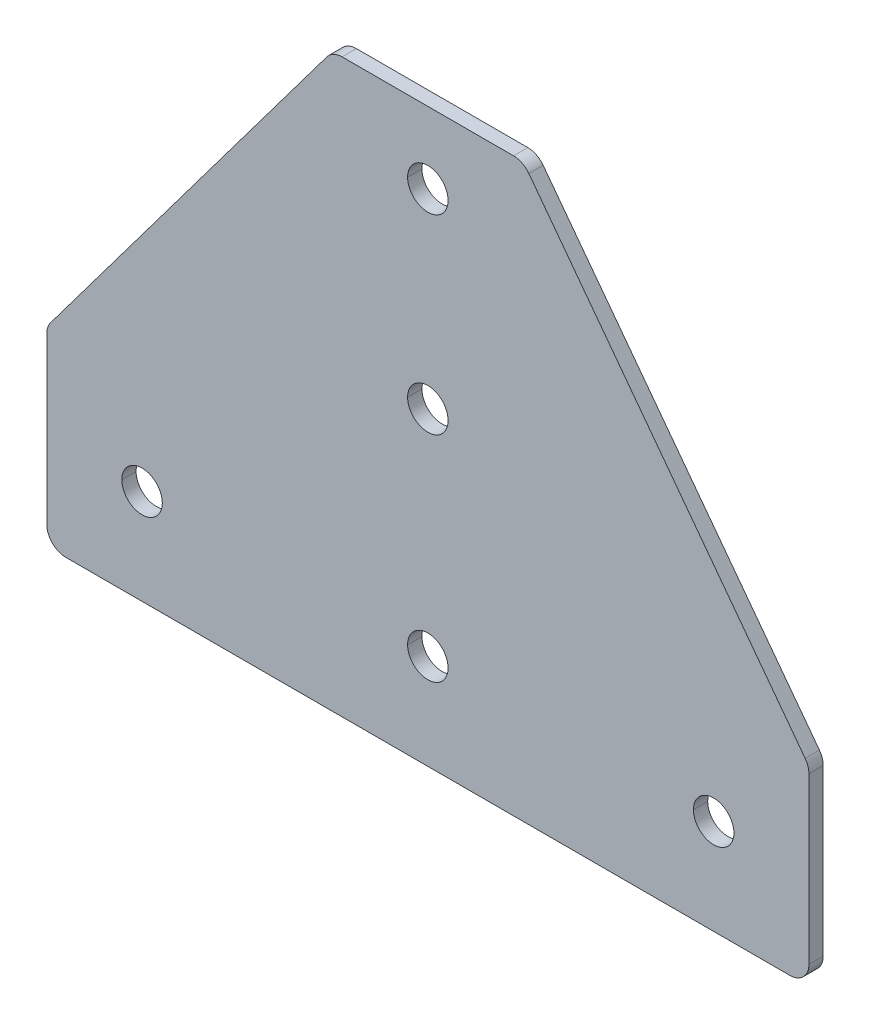
ISO-10303-21;
HEADER;
FILE_DESCRIPTION(('STEP AP214'),'2;1');
FILE_NAME('part.step','',(''),(''),'','','');
FILE_SCHEMA(('AUTOMOTIVE_DESIGN { 1 0 10303 214 1 1 1 1 }'));
ENDSEC;
DATA;
#1=APPLICATION_CONTEXT('core data for automotive mechanical design processes');
#2=APPLICATION_PROTOCOL_DEFINITION('international standard','automotive_design',2000,#1);
#3=PRODUCT_CONTEXT('',#1,'mechanical');
#4=PRODUCT('Part','Part','',(#3));
#5=PRODUCT_RELATED_PRODUCT_CATEGORY('part','',(#4));
#6=PRODUCT_DEFINITION_FORMATION('','',#4);
#7=PRODUCT_DEFINITION_CONTEXT('part definition',#1,'design');
#8=PRODUCT_DEFINITION('design','',#6,#7);
#9=PRODUCT_DEFINITION_SHAPE('','',#8);
#10=(LENGTH_UNIT() NAMED_UNIT(*) SI_UNIT(.MILLI.,.METRE.));
#11=(NAMED_UNIT(*) PLANE_ANGLE_UNIT() SI_UNIT($,.RADIAN.));
#12=(NAMED_UNIT(*) SI_UNIT($,.STERADIAN.) SOLID_ANGLE_UNIT());
#13=UNCERTAINTY_MEASURE_WITH_UNIT(LENGTH_MEASURE(1.E-05),#10,'distance_accuracy_value','');
#14=(GEOMETRIC_REPRESENTATION_CONTEXT(3) GLOBAL_UNCERTAINTY_ASSIGNED_CONTEXT((#13)) GLOBAL_UNIT_ASSIGNED_CONTEXT((#10,
#11,#12)) REPRESENTATION_CONTEXT('',''));
#15=CARTESIAN_POINT('',(0.,0.,0.));
#16=DIRECTION('',(0.,0.,1.));
#17=DIRECTION('',(1.,0.,0.));
#18=AXIS2_PLACEMENT_3D('',#15,#16,#17);
#19=CARTESIAN_POINT('',(0.,105.,3.));
#20=DIRECTION('',(0.,0.,-1.));
#21=DIRECTION('',(-1.,0.,0.));
#22=AXIS2_PLACEMENT_3D('',#19,#20,#21);
#23=CYLINDRICAL_SURFACE('',#22,4.25);
#24=DIRECTION('',(0.,0.,-1.));
#25=VECTOR('',#24,1.);
#26=CARTESIAN_POINT('',(4.25,105.,3.));
#27=LINE('',#26,#25);
#28=CARTESIAN_POINT('',(4.25,105.,3.));
#29=VERTEX_POINT('',#28);
#30=CARTESIAN_POINT('',(4.25,105.,0.));
#31=VERTEX_POINT('',#30);
#32=EDGE_CURVE('E436',#29,#31,#27,.T.);
#33=ORIENTED_EDGE('',*,*,#32,.F.);
#34=CARTESIAN_POINT('',(0.,105.,3.));
#35=DIRECTION('',(0.,0.,1.));
#36=DIRECTION('',(1.,0.,0.));
#37=AXIS2_PLACEMENT_3D('',#34,#35,#36);
#38=CIRCLE('',#37,4.25);
#39=CARTESIAN_POINT('',(-4.25,105.,3.));
#40=VERTEX_POINT('',#39);
#41=EDGE_CURVE('E306',#29,#40,#38,.T.);
#42=ORIENTED_EDGE('',*,*,#41,.T.);
#43=DIRECTION('',(0.,0.,-1.));
#44=VECTOR('',#43,1.);
#45=CARTESIAN_POINT('',(-4.25,105.,3.));
#46=LINE('',#45,#44);
#47=CARTESIAN_POINT('',(-4.25,105.,0.));
#48=VERTEX_POINT('',#47);
#49=EDGE_CURVE('E410',#40,#48,#46,.T.);
#50=ORIENTED_EDGE('',*,*,#49,.T.);
#51=CARTESIAN_POINT('',(0.,105.,0.));
#52=DIRECTION('',(0.,0.,1.));
#53=DIRECTION('',(1.,0.,0.));
#54=AXIS2_PLACEMENT_3D('',#51,#52,#53);
#55=CIRCLE('',#54,4.25);
#56=EDGE_CURVE('E251',#31,#48,#55,.T.);
#57=ORIENTED_EDGE('',*,*,#56,.F.);
#58=EDGE_LOOP('',(#33,#42,#50,#57));
#59=FACE_BOUND('',#58,.T.);
#60=ADVANCED_FACE('F16',(#59),#23,.F.);
#61=CARTESIAN_POINT('',(0.,65.,3.));
#62=DIRECTION('',(0.,0.,-1.));
#63=DIRECTION('',(-1.,0.,0.));
#64=AXIS2_PLACEMENT_3D('',#61,#62,#63);
#65=CYLINDRICAL_SURFACE('',#64,4.25);
#66=DIRECTION('',(0.,0.,-1.));
#67=VECTOR('',#66,1.);
#68=CARTESIAN_POINT('',(4.25,65.,3.));
#69=LINE('',#68,#67);
#70=CARTESIAN_POINT('',(4.25,65.,3.));
#71=VERTEX_POINT('',#70);
#72=CARTESIAN_POINT('',(4.25,65.,0.));
#73=VERTEX_POINT('',#72);
#74=EDGE_CURVE('E405',#71,#73,#69,.T.);
#75=ORIENTED_EDGE('',*,*,#74,.F.);
#76=CARTESIAN_POINT('',(0.,65.,3.));
#77=DIRECTION('',(0.,0.,1.));
#78=DIRECTION('',(1.,0.,0.));
#79=AXIS2_PLACEMENT_3D('',#76,#77,#78);
#80=CIRCLE('',#79,4.25);
#81=CARTESIAN_POINT('',(-4.25,65.,3.));
#82=VERTEX_POINT('',#81);
#83=EDGE_CURVE('E320',#71,#82,#80,.T.);
#84=ORIENTED_EDGE('',*,*,#83,.T.);
#85=DIRECTION('',(0.,0.,-1.));
#86=VECTOR('',#85,1.);
#87=CARTESIAN_POINT('',(-4.25,65.,3.));
#88=LINE('',#87,#86);
#89=CARTESIAN_POINT('',(-4.25,65.,0.));
#90=VERTEX_POINT('',#89);
#91=EDGE_CURVE('E397',#82,#90,#88,.T.);
#92=ORIENTED_EDGE('',*,*,#91,.T.);
#93=CARTESIAN_POINT('',(0.,65.,0.));
#94=DIRECTION('',(0.,0.,1.));
#95=DIRECTION('',(1.,0.,0.));
#96=AXIS2_PLACEMENT_3D('',#93,#94,#95);
#97=CIRCLE('',#96,4.25);
#98=EDGE_CURVE('E234',#73,#90,#97,.T.);
#99=ORIENTED_EDGE('',*,*,#98,.F.);
#100=EDGE_LOOP('',(#75,#84,#92,#99));
#101=FACE_BOUND('',#100,.T.);
#102=ADVANCED_FACE('F549',(#101),#65,.F.);
#103=CARTESIAN_POINT('',(-60.,20.,3.));
#104=DIRECTION('',(0.,0.,-1.));
#105=DIRECTION('',(-1.,0.,0.));
#106=AXIS2_PLACEMENT_3D('',#103,#104,#105);
#107=CYLINDRICAL_SURFACE('',#106,4.25);
#108=DIRECTION('',(0.,0.,-1.));
#109=VECTOR('',#108,1.);
#110=CARTESIAN_POINT('',(-55.75,20.,3.));
#111=LINE('',#110,#109);
#112=CARTESIAN_POINT('',(-55.75,20.,3.));
#113=VERTEX_POINT('',#112);
#114=CARTESIAN_POINT('',(-55.75,20.,0.));
#115=VERTEX_POINT('',#114);
#116=EDGE_CURVE('E392',#113,#115,#111,.T.);
#117=ORIENTED_EDGE('',*,*,#116,.F.);
#118=CARTESIAN_POINT('',(-60.,20.,3.));
#119=DIRECTION('',(0.,0.,1.));
#120=DIRECTION('',(1.,0.,0.));
#121=AXIS2_PLACEMENT_3D('',#118,#119,#120);
#122=CIRCLE('',#121,4.25);
#123=CARTESIAN_POINT('',(-64.25,20.,3.));
#124=VERTEX_POINT('',#123);
#125=EDGE_CURVE('E310',#113,#124,#122,.T.);
#126=ORIENTED_EDGE('',*,*,#125,.T.);
#127=DIRECTION('',(0.,0.,-1.));
#128=VECTOR('',#127,1.);
#129=CARTESIAN_POINT('',(-64.25,20.,3.));
#130=LINE('',#129,#128);
#131=CARTESIAN_POINT('',(-64.25,20.,0.));
#132=VERTEX_POINT('',#131);
#133=EDGE_CURVE('E391',#124,#132,#130,.T.);
#134=ORIENTED_EDGE('',*,*,#133,.T.);
#135=CARTESIAN_POINT('',(-60.,20.,0.));
#136=DIRECTION('',(0.,0.,1.));
#137=DIRECTION('',(1.,0.,0.));
#138=AXIS2_PLACEMENT_3D('',#135,#136,#137);
#139=CIRCLE('',#138,4.25);
#140=EDGE_CURVE('E248',#115,#132,#139,.T.);
#141=ORIENTED_EDGE('',*,*,#140,.F.);
#142=EDGE_LOOP('',(#117,#126,#134,#141));
#143=FACE_BOUND('',#142,.T.);
#144=ADVANCED_FACE('F18',(#143),#107,.F.);
#145=CARTESIAN_POINT('',(0.,20.,3.));
#146=DIRECTION('',(0.,0.,-1.));
#147=DIRECTION('',(-1.,0.,0.));
#148=AXIS2_PLACEMENT_3D('',#145,#146,#147);
#149=CYLINDRICAL_SURFACE('',#148,4.25);
#150=DIRECTION('',(0.,0.,-1.));
#151=VECTOR('',#150,1.);
#152=CARTESIAN_POINT('',(4.25,20.,3.));
#153=LINE('',#152,#151);
#154=CARTESIAN_POINT('',(4.25,20.,3.));
#155=VERTEX_POINT('',#154);
#156=CARTESIAN_POINT('',(4.25,20.,0.));
#157=VERTEX_POINT('',#156);
#158=EDGE_CURVE('E422',#155,#157,#153,.T.);
#159=ORIENTED_EDGE('',*,*,#158,.F.);
#160=CARTESIAN_POINT('',(0.,20.,3.));
#161=DIRECTION('',(0.,0.,1.));
#162=DIRECTION('',(1.,0.,0.));
#163=AXIS2_PLACEMENT_3D('',#160,#161,#162);
#164=CIRCLE('',#163,4.25);
#165=CARTESIAN_POINT('',(-4.25,20.,3.));
#166=VERTEX_POINT('',#165);
#167=EDGE_CURVE('E317',#155,#166,#164,.T.);
#168=ORIENTED_EDGE('',*,*,#167,.T.);
#169=DIRECTION('',(0.,0.,-1.));
#170=VECTOR('',#169,1.);
#171=CARTESIAN_POINT('',(-4.25,20.,3.));
#172=LINE('',#171,#170);
#173=CARTESIAN_POINT('',(-4.25,20.,0.));
#174=VERTEX_POINT('',#173);
#175=EDGE_CURVE('E386',#166,#174,#172,.T.);
#176=ORIENTED_EDGE('',*,*,#175,.T.);
#177=CARTESIAN_POINT('',(0.,20.,0.));
#178=DIRECTION('',(0.,0.,1.));
#179=DIRECTION('',(1.,0.,0.));
#180=AXIS2_PLACEMENT_3D('',#177,#178,#179);
#181=CIRCLE('',#180,4.25);
#182=EDGE_CURVE('E237',#157,#174,#181,.T.);
#183=ORIENTED_EDGE('',*,*,#182,.F.);
#184=EDGE_LOOP('',(#159,#168,#176,#183));
#185=FACE_BOUND('',#184,.T.);
#186=ADVANCED_FACE('F461',(#185),#149,.F.);
#187=CARTESIAN_POINT('',(60.,20.,3.));
#188=DIRECTION('',(0.,0.,-1.));
#189=DIRECTION('',(-1.,0.,0.));
#190=AXIS2_PLACEMENT_3D('',#187,#188,#189);
#191=CYLINDRICAL_SURFACE('',#190,4.25);
#192=DIRECTION('',(0.,0.,-1.));
#193=VECTOR('',#192,1.);
#194=CARTESIAN_POINT('',(64.25,20.,3.));
#195=LINE('',#194,#193);
#196=CARTESIAN_POINT('',(64.25,20.,3.));
#197=VERTEX_POINT('',#196);
#198=CARTESIAN_POINT('',(64.25,20.,0.));
#199=VERTEX_POINT('',#198);
#200=EDGE_CURVE('E378',#197,#199,#195,.T.);
#201=ORIENTED_EDGE('',*,*,#200,.F.);
#202=CARTESIAN_POINT('',(60.,20.,3.));
#203=DIRECTION('',(0.,0.,1.));
#204=DIRECTION('',(1.,0.,0.));
#205=AXIS2_PLACEMENT_3D('',#202,#203,#204);
#206=CIRCLE('',#205,4.25);
#207=CARTESIAN_POINT('',(55.75,20.,3.));
#208=VERTEX_POINT('',#207);
#209=EDGE_CURVE('E314',#197,#208,#206,.T.);
#210=ORIENTED_EDGE('',*,*,#209,.T.);
#211=DIRECTION('',(0.,0.,-1.));
#212=VECTOR('',#211,1.);
#213=CARTESIAN_POINT('',(55.75,20.,3.));
#214=LINE('',#213,#212);
#215=CARTESIAN_POINT('',(55.75,20.,0.));
#216=VERTEX_POINT('',#215);
#217=EDGE_CURVE('E370',#208,#216,#214,.T.);
#218=ORIENTED_EDGE('',*,*,#217,.T.);
#219=CARTESIAN_POINT('',(60.,20.,0.));
#220=DIRECTION('',(0.,0.,1.));
#221=DIRECTION('',(1.,0.,0.));
#222=AXIS2_PLACEMENT_3D('',#219,#220,#221);
#223=CIRCLE('',#222,4.25);
#224=EDGE_CURVE('E244',#199,#216,#223,.T.);
#225=ORIENTED_EDGE('',*,*,#224,.F.);
#226=EDGE_LOOP('',(#201,#210,#218,#225));
#227=FACE_BOUND('',#226,.T.);
#228=ADVANCED_FACE('F569',(#227),#191,.F.);
#229=CARTESIAN_POINT('',(-76.0000000000145,0.,3.));
#230=DIRECTION('',(0.,1.,0.));
#231=DIRECTION('',(1.,0.,0.));
#232=AXIS2_PLACEMENT_3D('',#229,#230,#231);
#233=PLANE('',#232);
#234=DIRECTION('',(1.,0.,0.));
#235=VECTOR('',#234,1.);
#236=CARTESIAN_POINT('',(-76.0000000000145,0.,0.));
#237=LINE('',#236,#235);
#238=CARTESIAN_POINT('',(-76.0000000000145,0.,0.));
#239=VERTEX_POINT('',#238);
#240=CARTESIAN_POINT('',(76.0000000000145,0.,0.));
#241=VERTEX_POINT('',#240);
#242=EDGE_CURVE('E296',#239,#241,#237,.T.);
#243=ORIENTED_EDGE('',*,*,#242,.T.);
#244=DIRECTION('',(0.,0.,-1.));
#245=VECTOR('',#244,1.);
#246=CARTESIAN_POINT('',(76.0000000000145,0.,3.));
#247=LINE('',#246,#245);
#248=CARTESIAN_POINT('',(76.0000000000145,0.,3.));
#249=VERTEX_POINT('',#248);
#250=EDGE_CURVE('E258',#249,#241,#247,.T.);
#251=ORIENTED_EDGE('',*,*,#250,.F.);
#252=DIRECTION('',(1.,0.,0.));
#253=VECTOR('',#252,1.);
#254=CARTESIAN_POINT('',(-76.0000000000145,0.,3.));
#255=LINE('',#254,#253);
#256=CARTESIAN_POINT('',(-76.0000000000145,0.,3.));
#257=VERTEX_POINT('',#256);
#258=EDGE_CURVE('E326',#257,#249,#255,.T.);
#259=ORIENTED_EDGE('',*,*,#258,.F.);
#260=DIRECTION('',(0.,0.,-1.));
#261=VECTOR('',#260,1.);
#262=CARTESIAN_POINT('',(-76.0000000000145,0.,3.));
#263=LINE('',#262,#261);
#264=EDGE_CURVE('E10',#257,#239,#263,.T.);
#265=ORIENTED_EDGE('',*,*,#264,.T.);
#266=EDGE_LOOP('',(#243,#251,#259,#265));
#267=FACE_BOUND('',#266,.T.);
#268=ADVANCED_FACE('F564',(#267),#233,.F.);
#269=CARTESIAN_POINT('',(-76.0000000000145,4.,3.));
#270=DIRECTION('',(0.,0.,-1.));
#271=DIRECTION('',(-1.,0.,0.));
#272=AXIS2_PLACEMENT_3D('',#269,#270,#271);
#273=CYLINDRICAL_SURFACE('',#272,4.);
#274=CARTESIAN_POINT('',(-76.0000000000145,4.,0.));
#275=DIRECTION('',(0.,0.,1.));
#276=DIRECTION('',(1.,0.,0.));
#277=AXIS2_PLACEMENT_3D('',#274,#275,#276);
#278=CIRCLE('',#277,4.);
#279=CARTESIAN_POINT('',(-80.0000000000146,4.,0.));
#280=VERTEX_POINT('',#279);
#281=EDGE_CURVE('E290',#280,#239,#278,.T.);
#282=ORIENTED_EDGE('',*,*,#281,.T.);
#283=ORIENTED_EDGE('',*,*,#264,.F.);
#284=CARTESIAN_POINT('',(-76.0000000000145,4.,3.));
#285=DIRECTION('',(0.,0.,1.));
#286=DIRECTION('',(1.,0.,0.));
#287=AXIS2_PLACEMENT_3D('',#284,#285,#286);
#288=CIRCLE('',#287,4.);
#289=CARTESIAN_POINT('',(-80.0000000000146,4.,3.));
#290=VERTEX_POINT('',#289);
#291=EDGE_CURVE('E332',#290,#257,#288,.T.);
#292=ORIENTED_EDGE('',*,*,#291,.F.);
#293=DIRECTION('',(0.,0.,-1.));
#294=VECTOR('',#293,1.);
#295=CARTESIAN_POINT('',(-80.0000000000146,4.,3.));
#296=LINE('',#295,#294);
#297=EDGE_CURVE('E26',#290,#280,#296,.T.);
#298=ORIENTED_EDGE('',*,*,#297,.T.);
#299=EDGE_LOOP('',(#282,#283,#292,#298));
#300=FACE_BOUND('',#299,.T.);
#301=ADVANCED_FACE('F560',(#300),#273,.T.);
#302=CARTESIAN_POINT('',(-80.0000000000146,4.,3.));
#303=DIRECTION('',(1.,0.,0.));
#304=DIRECTION('',(0.,1.,0.));
#305=AXIS2_PLACEMENT_3D('',#302,#303,#304);
#306=PLANE('',#305);
#307=DIRECTION('',(0.,-1.,0.));
#308=VECTOR('',#307,1.);
#309=CARTESIAN_POINT('',(-80.0000000000146,4.,0.));
#310=LINE('',#309,#308);
#311=CARTESIAN_POINT('',(-80.0000000000146,38.6666666666538,0.));
#312=VERTEX_POINT('',#311);
#313=EDGE_CURVE('E280',#312,#280,#310,.T.);
#314=ORIENTED_EDGE('',*,*,#313,.T.);
#315=ORIENTED_EDGE('',*,*,#297,.F.);
#316=DIRECTION('',(0.,-1.,0.));
#317=VECTOR('',#316,1.);
#318=CARTESIAN_POINT('',(-80.0000000000146,4.,3.));
#319=LINE('',#318,#317);
#320=CARTESIAN_POINT('',(-80.0000000000146,38.6666666666538,3.));
#321=VERTEX_POINT('',#320);
#322=EDGE_CURVE('E283',#321,#290,#319,.T.);
#323=ORIENTED_EDGE('',*,*,#322,.F.);
#324=DIRECTION('',(0.,0.,-1.));
#325=VECTOR('',#324,1.);
#326=CARTESIAN_POINT('',(-80.0000000000146,38.6666666666538,3.));
#327=LINE('',#326,#325);
#328=EDGE_CURVE('E20',#321,#312,#327,.T.);
#329=ORIENTED_EDGE('',*,*,#328,.T.);
#330=EDGE_LOOP('',(#314,#315,#323,#329));
#331=FACE_BOUND('',#330,.T.);
#332=ADVANCED_FACE('F278',(#331),#306,.F.);
#333=CARTESIAN_POINT('',(-76.0000000000145,38.6666666666538,3.));
#334=DIRECTION('',(0.,0.,-1.));
#335=DIRECTION('',(-1.,0.,0.));
#336=AXIS2_PLACEMENT_3D('',#333,#334,#335);
#337=CYLINDRICAL_SURFACE('',#336,4.);
#338=CARTESIAN_POINT('',(-76.0000000000145,38.6666666666538,0.));
#339=DIRECTION('',(0.,0.,1.));
#340=DIRECTION('',(1.,0.,0.));
#341=AXIS2_PLACEMENT_3D('',#338,#339,#340);
#342=CIRCLE('',#341,4.);
#343=CARTESIAN_POINT('',(-79.2000000000145,41.0666666666539,0.));
#344=VERTEX_POINT('',#343);
#345=EDGE_CURVE('E224',#344,#312,#342,.T.);
#346=ORIENTED_EDGE('',*,*,#345,.T.);
#347=ORIENTED_EDGE('',*,*,#328,.F.);
#348=CARTESIAN_POINT('',(-76.0000000000145,38.6666666666538,3.));
#349=DIRECTION('',(0.,0.,1.));
#350=DIRECTION('',(1.,0.,0.));
#351=AXIS2_PLACEMENT_3D('',#348,#349,#350);
#352=CIRCLE('',#351,4.);
#353=CARTESIAN_POINT('',(-79.2000000000145,41.0666666666539,3.));
#354=VERTEX_POINT('',#353);
#355=EDGE_CURVE('E341',#354,#321,#352,.T.);
#356=ORIENTED_EDGE('',*,*,#355,.F.);
#357=DIRECTION('',(0.,0.,-1.));
#358=VECTOR('',#357,1.);
#359=CARTESIAN_POINT('',(-79.2000000000145,41.0666666666539,3.));
#360=LINE('',#359,#358);
#361=EDGE_CURVE('E241',#354,#344,#360,.T.);
#362=ORIENTED_EDGE('',*,*,#361,.T.);
#363=EDGE_LOOP('',(#346,#347,#356,#362));
#364=FACE_BOUND('',#363,.T.);
#365=ADVANCED_FACE('F285',(#364),#337,.T.);
#366=CARTESIAN_POINT('',(-21.2,118.4,3.));
#367=DIRECTION('',(0.799999999999976,-0.600000000000032,0.));
#368=DIRECTION('',(0.,0.,-1.));
#369=AXIS2_PLACEMENT_3D('',#366,#367,#368);
#370=PLANE('',#369);
#371=DIRECTION('',(-0.600000000000032,-0.799999999999976,0.));
#372=VECTOR('',#371,1.);
#373=CARTESIAN_POINT('',(-21.2,118.4,0.));
#374=LINE('',#373,#372);
#375=CARTESIAN_POINT('',(-21.2,118.4,0.));
#376=VERTEX_POINT('',#375);
#377=EDGE_CURVE('E217',#376,#344,#374,.T.);
#378=ORIENTED_EDGE('',*,*,#377,.T.);
#379=ORIENTED_EDGE('',*,*,#361,.F.);
#380=DIRECTION('',(-0.600000000000032,-0.799999999999976,0.));
#381=VECTOR('',#380,1.);
#382=CARTESIAN_POINT('',(-21.2,118.4,3.));
#383=LINE('',#382,#381);
#384=CARTESIAN_POINT('',(-21.2,118.4,3.));
#385=VERTEX_POINT('',#384);
#386=EDGE_CURVE('E344',#385,#354,#383,.T.);
#387=ORIENTED_EDGE('',*,*,#386,.F.);
#388=DIRECTION('',(0.,0.,-1.));
#389=VECTOR('',#388,1.);
#390=CARTESIAN_POINT('',(-21.2,118.4,3.));
#391=LINE('',#390,#389);
#392=EDGE_CURVE('E201',#385,#376,#391,.T.);
#393=ORIENTED_EDGE('',*,*,#392,.T.);
#394=EDGE_LOOP('',(#378,#379,#387,#393));
#395=FACE_BOUND('',#394,.T.);
#396=ADVANCED_FACE('F537',(#395),#370,.F.);
#397=CARTESIAN_POINT('',(-18.0000000000003,116.,3.));
#398=DIRECTION('',(0.,0.,-1.));
#399=DIRECTION('',(-1.,0.,0.));
#400=AXIS2_PLACEMENT_3D('',#397,#398,#399);
#401=CYLINDRICAL_SURFACE('',#400,3.99999999999963);
#402=CARTESIAN_POINT('',(-18.0000000000003,116.,0.));
#403=DIRECTION('',(0.,0.,1.));
#404=DIRECTION('',(1.,0.,0.));
#405=AXIS2_PLACEMENT_3D('',#402,#403,#404);
#406=CIRCLE('',#405,3.99999999999963);
#407=CARTESIAN_POINT('',(-18.0000000000003,120.,0.));
#408=VERTEX_POINT('',#407);
#409=EDGE_CURVE('E193',#408,#376,#406,.T.);
#410=ORIENTED_EDGE('',*,*,#409,.T.);
#411=ORIENTED_EDGE('',*,*,#392,.F.);
#412=CARTESIAN_POINT('',(-18.0000000000003,116.,3.));
#413=DIRECTION('',(0.,0.,1.));
#414=DIRECTION('',(1.,0.,0.));
#415=AXIS2_PLACEMENT_3D('',#412,#413,#414);
#416=CIRCLE('',#415,3.99999999999963);
#417=CARTESIAN_POINT('',(-18.0000000000003,120.,3.));
#418=VERTEX_POINT('',#417);
#419=EDGE_CURVE('E196',#418,#385,#416,.T.);
#420=ORIENTED_EDGE('',*,*,#419,.F.);
#421=DIRECTION('',(0.,0.,-1.));
#422=VECTOR('',#421,1.);
#423=CARTESIAN_POINT('',(-18.0000000000003,120.,3.));
#424=LINE('',#423,#422);
#425=EDGE_CURVE('E189',#418,#408,#424,.T.);
#426=ORIENTED_EDGE('',*,*,#425,.T.);
#427=EDGE_LOOP('',(#410,#411,#420,#426));
#428=FACE_BOUND('',#427,.T.);
#429=ADVANCED_FACE('F191',(#428),#401,.T.);
#430=CARTESIAN_POINT('',(18.0000000000003,120.,3.));
#431=DIRECTION('',(0.,-1.,0.));
#432=DIRECTION('',(0.,0.,-1.));
#433=AXIS2_PLACEMENT_3D('',#430,#431,#432);
#434=PLANE('',#433);
#435=DIRECTION('',(-1.,0.,0.));
#436=VECTOR('',#435,1.);
#437=CARTESIAN_POINT('',(18.0000000000003,120.,0.));
#438=LINE('',#437,#436);
#439=CARTESIAN_POINT('',(18.0000000000003,120.,0.));
#440=VERTEX_POINT('',#439);
#441=EDGE_CURVE('E205',#440,#408,#438,.T.);
#442=ORIENTED_EDGE('',*,*,#441,.T.);
#443=ORIENTED_EDGE('',*,*,#425,.F.);
#444=DIRECTION('',(-1.,0.,0.));
#445=VECTOR('',#444,1.);
#446=CARTESIAN_POINT('',(18.0000000000003,120.,3.));
#447=LINE('',#446,#445);
#448=CARTESIAN_POINT('',(18.0000000000003,120.,3.));
#449=VERTEX_POINT('',#448);
#450=EDGE_CURVE('E350',#449,#418,#447,.T.);
#451=ORIENTED_EDGE('',*,*,#450,.F.);
#452=DIRECTION('',(0.,0.,-1.));
#453=VECTOR('',#452,1.);
#454=CARTESIAN_POINT('',(18.0000000000003,120.,3.));
#455=LINE('',#454,#453);
#456=EDGE_CURVE('E202',#449,#440,#455,.T.);
#457=ORIENTED_EDGE('',*,*,#456,.T.);
#458=EDGE_LOOP('',(#442,#443,#451,#457));
#459=FACE_BOUND('',#458,.T.);
#460=ADVANCED_FACE('F206',(#459),#434,.F.);
#461=CARTESIAN_POINT('',(18.0000000000003,116.,3.));
#462=DIRECTION('',(0.,0.,-1.));
#463=DIRECTION('',(-1.,0.,0.));
#464=AXIS2_PLACEMENT_3D('',#461,#462,#463);
#465=CYLINDRICAL_SURFACE('',#464,4.);
#466=CARTESIAN_POINT('',(18.0000000000003,116.,0.));
#467=DIRECTION('',(0.,0.,1.));
#468=DIRECTION('',(1.,0.,0.));
#469=AXIS2_PLACEMENT_3D('',#466,#467,#468);
#470=CIRCLE('',#469,4.);
#471=CARTESIAN_POINT('',(21.2,118.4,0.));
#472=VERTEX_POINT('',#471);
#473=EDGE_CURVE('E211',#472,#440,#470,.T.);
#474=ORIENTED_EDGE('',*,*,#473,.T.);
#475=ORIENTED_EDGE('',*,*,#456,.F.);
#476=CARTESIAN_POINT('',(18.0000000000003,116.,3.));
#477=DIRECTION('',(0.,0.,1.));
#478=DIRECTION('',(1.,0.,0.));
#479=AXIS2_PLACEMENT_3D('',#476,#477,#478);
#480=CIRCLE('',#479,4.);
#481=CARTESIAN_POINT('',(21.2,118.4,3.));
#482=VERTEX_POINT('',#481);
#483=EDGE_CURVE('E353',#482,#449,#480,.T.);
#484=ORIENTED_EDGE('',*,*,#483,.F.);
#485=DIRECTION('',(0.,0.,-1.));
#486=VECTOR('',#485,1.);
#487=CARTESIAN_POINT('',(21.2,118.4,3.));
#488=LINE('',#487,#486);
#489=EDGE_CURVE('E261',#482,#472,#488,.T.);
#490=ORIENTED_EDGE('',*,*,#489,.T.);
#491=EDGE_LOOP('',(#474,#475,#484,#490));
#492=FACE_BOUND('',#491,.T.);
#493=ADVANCED_FACE('F534',(#492),#465,.T.);
#494=CARTESIAN_POINT('',(21.2,118.4,3.));
#495=DIRECTION('',(-0.79999999999993,-0.600000000000093,0.));
#496=DIRECTION('',(-0.600000000000093,0.79999999999993,0.));
#497=AXIS2_PLACEMENT_3D('',#494,#495,#496);
#498=PLANE('',#497);
#499=DIRECTION('',(-0.600000000000093,0.79999999999993,0.));
#500=VECTOR('',#499,1.);
#501=CARTESIAN_POINT('',(21.2,118.4,0.));
#502=LINE('',#501,#500);
#503=CARTESIAN_POINT('',(79.2000000000143,41.0666666666668,0.));
#504=VERTEX_POINT('',#503);
#505=EDGE_CURVE('E230',#504,#472,#502,.T.);
#506=ORIENTED_EDGE('',*,*,#505,.T.);
#507=ORIENTED_EDGE('',*,*,#489,.F.);
#508=DIRECTION('',(-0.600000000000093,0.79999999999993,0.));
#509=VECTOR('',#508,1.);
#510=CARTESIAN_POINT('',(21.2,118.4,3.));
#511=LINE('',#510,#509);
#512=CARTESIAN_POINT('',(79.2000000000143,41.0666666666668,3.));
#513=VERTEX_POINT('',#512);
#514=EDGE_CURVE('E354',#513,#482,#511,.T.);
#515=ORIENTED_EDGE('',*,*,#514,.F.);
#516=DIRECTION('',(0.,0.,-1.));
#517=VECTOR('',#516,1.);
#518=CARTESIAN_POINT('',(79.2000000000143,41.0666666666668,3.));
#519=LINE('',#518,#517);
#520=EDGE_CURVE('E54',#513,#504,#519,.T.);
#521=ORIENTED_EDGE('',*,*,#520,.T.);
#522=EDGE_LOOP('',(#506,#507,#515,#521));
#523=FACE_BOUND('',#522,.T.);
#524=ADVANCED_FACE('F531',(#523),#498,.F.);
#525=CARTESIAN_POINT('',(76.0000000000145,38.6666666666664,3.));
#526=DIRECTION('',(0.,0.,-1.));
#527=DIRECTION('',(-1.,0.,0.));
#528=AXIS2_PLACEMENT_3D('',#525,#526,#527);
#529=CYLINDRICAL_SURFACE('',#528,4.);
#530=CARTESIAN_POINT('',(76.0000000000145,38.6666666666664,0.));
#531=DIRECTION('',(0.,0.,1.));
#532=DIRECTION('',(1.,0.,0.));
#533=AXIS2_PLACEMENT_3D('',#530,#531,#532);
#534=CIRCLE('',#533,4.);
#535=CARTESIAN_POINT('',(80.0000000000146,38.6666666666664,0.));
#536=VERTEX_POINT('',#535);
#537=EDGE_CURVE('E233',#536,#504,#534,.T.);
#538=ORIENTED_EDGE('',*,*,#537,.T.);
#539=ORIENTED_EDGE('',*,*,#520,.F.);
#540=CARTESIAN_POINT('',(76.0000000000145,38.6666666666664,3.));
#541=DIRECTION('',(0.,0.,1.));
#542=DIRECTION('',(1.,0.,0.));
#543=AXIS2_PLACEMENT_3D('',#540,#541,#542);
#544=CIRCLE('',#543,4.);
#545=CARTESIAN_POINT('',(80.0000000000146,38.6666666666664,3.));
#546=VERTEX_POINT('',#545);
#547=EDGE_CURVE('E358',#546,#513,#544,.T.);
#548=ORIENTED_EDGE('',*,*,#547,.F.);
#549=DIRECTION('',(0.,0.,-1.));
#550=VECTOR('',#549,1.);
#551=CARTESIAN_POINT('',(80.0000000000146,38.6666666666664,3.));
#552=LINE('',#551,#550);
#553=EDGE_CURVE('E40',#546,#536,#552,.T.);
#554=ORIENTED_EDGE('',*,*,#553,.T.);
#555=EDGE_LOOP('',(#538,#539,#548,#554));
#556=FACE_BOUND('',#555,.T.);
#557=ADVANCED_FACE('F529',(#556),#529,.T.);
#558=CARTESIAN_POINT('',(80.0000000000146,4.,3.));
#559=DIRECTION('',(-1.,0.,0.));
#560=DIRECTION('',(0.,1.,0.));
#561=AXIS2_PLACEMENT_3D('',#558,#559,#560);
#562=PLANE('',#561);
#563=DIRECTION('',(0.,1.,0.));
#564=VECTOR('',#563,1.);
#565=CARTESIAN_POINT('',(80.0000000000146,4.,0.));
#566=LINE('',#565,#564);
#567=CARTESIAN_POINT('',(80.0000000000146,4.,0.));
#568=VERTEX_POINT('',#567);
#569=EDGE_CURVE('E238',#568,#536,#566,.T.);
#570=ORIENTED_EDGE('',*,*,#569,.T.);
#571=ORIENTED_EDGE('',*,*,#553,.F.);
#572=DIRECTION('',(0.,1.,0.));
#573=VECTOR('',#572,1.);
#574=CARTESIAN_POINT('',(80.0000000000146,4.,3.));
#575=LINE('',#574,#573);
#576=CARTESIAN_POINT('',(80.0000000000146,4.,3.));
#577=VERTEX_POINT('',#576);
#578=EDGE_CURVE('E364',#577,#546,#575,.T.);
#579=ORIENTED_EDGE('',*,*,#578,.F.);
#580=DIRECTION('',(0.,0.,-1.));
#581=VECTOR('',#580,1.);
#582=CARTESIAN_POINT('',(80.0000000000146,4.,3.));
#583=LINE('',#582,#581);
#584=EDGE_CURVE('E255',#577,#568,#583,.T.);
#585=ORIENTED_EDGE('',*,*,#584,.T.);
#586=EDGE_LOOP('',(#570,#571,#579,#585));
#587=FACE_BOUND('',#586,.T.);
#588=ADVANCED_FACE('F527',(#587),#562,.F.);
#589=CARTESIAN_POINT('',(76.0000000000145,4.,3.));
#590=DIRECTION('',(0.,0.,-1.));
#591=DIRECTION('',(-1.,0.,0.));
#592=AXIS2_PLACEMENT_3D('',#589,#590,#591);
#593=CYLINDRICAL_SURFACE('',#592,4.);
#594=CARTESIAN_POINT('',(76.0000000000145,4.,0.));
#595=DIRECTION('',(0.,0.,1.));
#596=DIRECTION('',(1.,0.,0.));
#597=AXIS2_PLACEMENT_3D('',#594,#595,#596);
#598=CIRCLE('',#597,4.);
#599=EDGE_CURVE('E302',#241,#568,#598,.T.);
#600=ORIENTED_EDGE('',*,*,#599,.T.);
#601=ORIENTED_EDGE('',*,*,#584,.F.);
#602=CARTESIAN_POINT('',(76.0000000000145,4.,3.));
#603=DIRECTION('',(0.,0.,1.));
#604=DIRECTION('',(1.,0.,0.));
#605=AXIS2_PLACEMENT_3D('',#602,#603,#604);
#606=CIRCLE('',#605,4.);
#607=EDGE_CURVE('E366',#249,#577,#606,.T.);
#608=ORIENTED_EDGE('',*,*,#607,.F.);
#609=ORIENTED_EDGE('',*,*,#250,.T.);
#610=EDGE_LOOP('',(#600,#601,#608,#609));
#611=FACE_BOUND('',#610,.T.);
#612=ADVANCED_FACE('F524',(#611),#593,.T.);
#613=CARTESIAN_POINT('',(76.0000000000145,4.,0.));
#614=DIRECTION('',(0.,0.,1.));
#615=DIRECTION('',(1.,0.,0.));
#616=AXIS2_PLACEMENT_3D('',#613,#614,#615);
#617=PLANE('',#616);
#618=CARTESIAN_POINT('',(0.,105.,0.));
#619=DIRECTION('',(0.,0.,1.));
#620=DIRECTION('',(1.,0.,0.));
#621=AXIS2_PLACEMENT_3D('',#618,#619,#620);
#622=CIRCLE('',#621,4.25);
#623=EDGE_CURVE('E429',#48,#31,#622,.T.);
#624=ORIENTED_EDGE('',*,*,#623,.T.);
#625=ORIENTED_EDGE('',*,*,#56,.T.);
#626=EDGE_LOOP('',(#624,#625));
#627=FACE_BOUND('',#626,.T.);
#628=CARTESIAN_POINT('',(-60.,20.,0.));
#629=DIRECTION('',(0.,0.,1.));
#630=DIRECTION('',(1.,0.,0.));
#631=AXIS2_PLACEMENT_3D('',#628,#629,#630);
#632=CIRCLE('',#631,4.25);
#633=EDGE_CURVE('E387',#132,#115,#632,.T.);
#634=ORIENTED_EDGE('',*,*,#633,.T.);
#635=ORIENTED_EDGE('',*,*,#140,.T.);
#636=EDGE_LOOP('',(#634,#635));
#637=FACE_BOUND('',#636,.T.);
#638=CARTESIAN_POINT('',(60.,20.,0.));
#639=DIRECTION('',(0.,0.,1.));
#640=DIRECTION('',(1.,0.,0.));
#641=AXIS2_PLACEMENT_3D('',#638,#639,#640);
#642=CIRCLE('',#641,4.25);
#643=EDGE_CURVE('E374',#216,#199,#642,.T.);
#644=ORIENTED_EDGE('',*,*,#643,.T.);
#645=ORIENTED_EDGE('',*,*,#224,.T.);
#646=EDGE_LOOP('',(#644,#645));
#647=FACE_BOUND('',#646,.T.);
#648=CARTESIAN_POINT('',(0.,20.,0.));
#649=DIRECTION('',(0.,0.,1.));
#650=DIRECTION('',(1.,0.,0.));
#651=AXIS2_PLACEMENT_3D('',#648,#649,#650);
#652=CIRCLE('',#651,4.25);
#653=EDGE_CURVE('E418',#174,#157,#652,.T.);
#654=ORIENTED_EDGE('',*,*,#653,.T.);
#655=ORIENTED_EDGE('',*,*,#182,.T.);
#656=EDGE_LOOP('',(#654,#655));
#657=FACE_BOUND('',#656,.T.);
#658=CARTESIAN_POINT('',(0.,65.,0.));
#659=DIRECTION('',(0.,0.,1.));
#660=DIRECTION('',(1.,0.,0.));
#661=AXIS2_PLACEMENT_3D('',#658,#659,#660);
#662=CIRCLE('',#661,4.25);
#663=EDGE_CURVE('E401',#90,#73,#662,.T.);
#664=ORIENTED_EDGE('',*,*,#663,.T.);
#665=ORIENTED_EDGE('',*,*,#98,.T.);
#666=EDGE_LOOP('',(#664,#665));
#667=FACE_BOUND('',#666,.T.);
#668=ORIENTED_EDGE('',*,*,#599,.F.);
#669=ORIENTED_EDGE('',*,*,#242,.F.);
#670=ORIENTED_EDGE('',*,*,#281,.F.);
#671=ORIENTED_EDGE('',*,*,#313,.F.);
#672=ORIENTED_EDGE('',*,*,#345,.F.);
#673=ORIENTED_EDGE('',*,*,#377,.F.);
#674=ORIENTED_EDGE('',*,*,#409,.F.);
#675=ORIENTED_EDGE('',*,*,#441,.F.);
#676=ORIENTED_EDGE('',*,*,#473,.F.);
#677=ORIENTED_EDGE('',*,*,#505,.F.);
#678=ORIENTED_EDGE('',*,*,#537,.F.);
#679=ORIENTED_EDGE('',*,*,#569,.F.);
#680=EDGE_LOOP('',(#668,#669,#670,#671,#672,#673,#674,#675,#676,#677,#678,#679));
#681=FACE_BOUND('',#680,.T.);
#682=ADVANCED_FACE('F214',(#627,#637,#647,#657,#667,#681),#617,.F.);
#683=CARTESIAN_POINT('',(76.0000000000145,4.,3.));
#684=DIRECTION('',(0.,0.,1.));
#685=DIRECTION('',(1.,0.,0.));
#686=AXIS2_PLACEMENT_3D('',#683,#684,#685);
#687=PLANE('',#686);
#688=CARTESIAN_POINT('',(0.,105.,3.));
#689=DIRECTION('',(0.,0.,1.));
#690=DIRECTION('',(1.,0.,0.));
#691=AXIS2_PLACEMENT_3D('',#688,#689,#690);
#692=CIRCLE('',#691,4.25);
#693=EDGE_CURVE('E440',#40,#29,#692,.T.);
#694=ORIENTED_EDGE('',*,*,#693,.F.);
#695=ORIENTED_EDGE('',*,*,#41,.F.);
#696=EDGE_LOOP('',(#694,#695));
#697=FACE_BOUND('',#696,.T.);
#698=CARTESIAN_POINT('',(-60.,20.,3.));
#699=DIRECTION('',(0.,0.,1.));
#700=DIRECTION('',(1.,0.,0.));
#701=AXIS2_PLACEMENT_3D('',#698,#699,#700);
#702=CIRCLE('',#701,4.25);
#703=EDGE_CURVE('E393',#124,#113,#702,.T.);
#704=ORIENTED_EDGE('',*,*,#703,.F.);
#705=ORIENTED_EDGE('',*,*,#125,.F.);
#706=EDGE_LOOP('',(#704,#705));
#707=FACE_BOUND('',#706,.T.);
#708=CARTESIAN_POINT('',(60.,20.,3.));
#709=DIRECTION('',(0.,0.,1.));
#710=DIRECTION('',(1.,0.,0.));
#711=AXIS2_PLACEMENT_3D('',#708,#709,#710);
#712=CIRCLE('',#711,4.25);
#713=EDGE_CURVE('E382',#208,#197,#712,.T.);
#714=ORIENTED_EDGE('',*,*,#713,.F.);
#715=ORIENTED_EDGE('',*,*,#209,.F.);
#716=EDGE_LOOP('',(#714,#715));
#717=FACE_BOUND('',#716,.T.);
#718=CARTESIAN_POINT('',(0.,20.,3.));
#719=DIRECTION('',(0.,0.,1.));
#720=DIRECTION('',(1.,0.,0.));
#721=AXIS2_PLACEMENT_3D('',#718,#719,#720);
#722=CIRCLE('',#721,4.25);
#723=EDGE_CURVE('E417',#166,#155,#722,.T.);
#724=ORIENTED_EDGE('',*,*,#723,.F.);
#725=ORIENTED_EDGE('',*,*,#167,.F.);
#726=EDGE_LOOP('',(#724,#725));
#727=FACE_BOUND('',#726,.T.);
#728=CARTESIAN_POINT('',(0.,65.,3.));
#729=DIRECTION('',(0.,0.,1.));
#730=DIRECTION('',(1.,0.,0.));
#731=AXIS2_PLACEMENT_3D('',#728,#729,#730);
#732=CIRCLE('',#731,4.25);
#733=EDGE_CURVE('E406',#82,#71,#732,.T.);
#734=ORIENTED_EDGE('',*,*,#733,.F.);
#735=ORIENTED_EDGE('',*,*,#83,.F.);
#736=EDGE_LOOP('',(#734,#735));
#737=FACE_BOUND('',#736,.T.);
#738=ORIENTED_EDGE('',*,*,#607,.T.);
#739=ORIENTED_EDGE('',*,*,#578,.T.);
#740=ORIENTED_EDGE('',*,*,#547,.T.);
#741=ORIENTED_EDGE('',*,*,#514,.T.);
#742=ORIENTED_EDGE('',*,*,#483,.T.);
#743=ORIENTED_EDGE('',*,*,#450,.T.);
#744=ORIENTED_EDGE('',*,*,#419,.T.);
#745=ORIENTED_EDGE('',*,*,#386,.T.);
#746=ORIENTED_EDGE('',*,*,#355,.T.);
#747=ORIENTED_EDGE('',*,*,#322,.T.);
#748=ORIENTED_EDGE('',*,*,#291,.T.);
#749=ORIENTED_EDGE('',*,*,#258,.T.);
#750=EDGE_LOOP('',(#738,#739,#740,#741,#742,#743,#744,#745,#746,#747,#748,#749));
#751=FACE_BOUND('',#750,.T.);
#752=ADVANCED_FACE('F510',(#697,#707,#717,#727,#737,#751),#687,.T.);
#753=CARTESIAN_POINT('',(60.,20.,3.));
#754=DIRECTION('',(0.,0.,-1.));
#755=DIRECTION('',(-1.,0.,0.));
#756=AXIS2_PLACEMENT_3D('',#753,#754,#755);
#757=CYLINDRICAL_SURFACE('',#756,4.25);
#758=ORIENTED_EDGE('',*,*,#713,.T.);
#759=ORIENTED_EDGE('',*,*,#200,.T.);
#760=ORIENTED_EDGE('',*,*,#643,.F.);
#761=ORIENTED_EDGE('',*,*,#217,.F.);
#762=EDGE_LOOP('',(#758,#759,#760,#761));
#763=FACE_BOUND('',#762,.T.);
#764=ADVANCED_FACE('F513',(#763),#757,.F.);
#765=CARTESIAN_POINT('',(0.,20.,3.));
#766=DIRECTION('',(0.,0.,-1.));
#767=DIRECTION('',(-1.,0.,0.));
#768=AXIS2_PLACEMENT_3D('',#765,#766,#767);
#769=CYLINDRICAL_SURFACE('',#768,4.25);
#770=ORIENTED_EDGE('',*,*,#723,.T.);
#771=ORIENTED_EDGE('',*,*,#158,.T.);
#772=ORIENTED_EDGE('',*,*,#653,.F.);
#773=ORIENTED_EDGE('',*,*,#175,.F.);
#774=EDGE_LOOP('',(#770,#771,#772,#773));
#775=FACE_BOUND('',#774,.T.);
#776=ADVANCED_FACE('F465',(#775),#769,.F.);
#777=CARTESIAN_POINT('',(-60.,20.,3.));
#778=DIRECTION('',(0.,0.,-1.));
#779=DIRECTION('',(-1.,0.,0.));
#780=AXIS2_PLACEMENT_3D('',#777,#778,#779);
#781=CYLINDRICAL_SURFACE('',#780,4.25);
#782=ORIENTED_EDGE('',*,*,#703,.T.);
#783=ORIENTED_EDGE('',*,*,#116,.T.);
#784=ORIENTED_EDGE('',*,*,#633,.F.);
#785=ORIENTED_EDGE('',*,*,#133,.F.);
#786=EDGE_LOOP('',(#782,#783,#784,#785));
#787=FACE_BOUND('',#786,.T.);
#788=ADVANCED_FACE('F509',(#787),#781,.F.);
#789=CARTESIAN_POINT('',(0.,65.,3.));
#790=DIRECTION('',(0.,0.,-1.));
#791=DIRECTION('',(-1.,0.,0.));
#792=AXIS2_PLACEMENT_3D('',#789,#790,#791);
#793=CYLINDRICAL_SURFACE('',#792,4.25);
#794=ORIENTED_EDGE('',*,*,#733,.T.);
#795=ORIENTED_EDGE('',*,*,#74,.T.);
#796=ORIENTED_EDGE('',*,*,#663,.F.);
#797=ORIENTED_EDGE('',*,*,#91,.F.);
#798=EDGE_LOOP('',(#794,#795,#796,#797));
#799=FACE_BOUND('',#798,.T.);
#800=ADVANCED_FACE('F804',(#799),#793,.F.);
#801=CARTESIAN_POINT('',(0.,105.,3.));
#802=DIRECTION('',(0.,0.,-1.));
#803=DIRECTION('',(-1.,0.,0.));
#804=AXIS2_PLACEMENT_3D('',#801,#802,#803);
#805=CYLINDRICAL_SURFACE('',#804,4.25);
#806=ORIENTED_EDGE('',*,*,#693,.T.);
#807=ORIENTED_EDGE('',*,*,#32,.T.);
#808=ORIENTED_EDGE('',*,*,#623,.F.);
#809=ORIENTED_EDGE('',*,*,#49,.F.);
#810=EDGE_LOOP('',(#806,#807,#808,#809));
#811=FACE_BOUND('',#810,.T.);
#812=ADVANCED_FACE('F815',(#811),#805,.F.);
#813=CLOSED_SHELL('',(#60,#102,#144,#186,#228,#268,#301,#332,#365,#396,#429,#460,#493,#524,#557,
#588,#612,#682,#752,#764,#776,#788,#800,#812));
#814=MANIFOLD_SOLID_BREP('B1',#813);
#815=ADVANCED_BREP_SHAPE_REPRESENTATION('',(#18,#814),#14);
#816=SHAPE_DEFINITION_REPRESENTATION(#9,#815);
ENDSEC;
END-ISO-10303-21;
